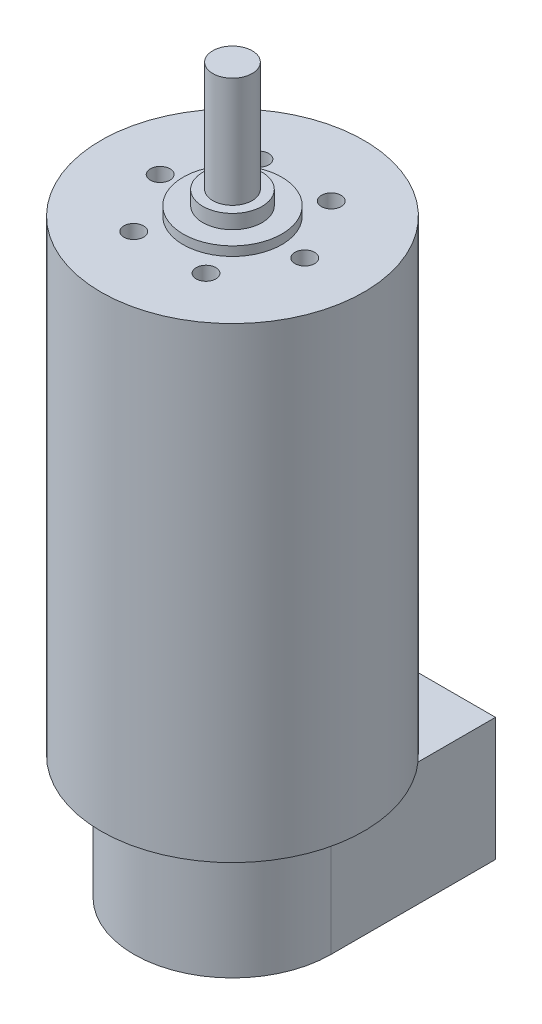
ISO-10303-21;
HEADER;
FILE_DESCRIPTION(('STEP AP214'),'2;1');
FILE_NAME('part.step','',(''),(''),'','','');
FILE_SCHEMA(('AUTOMOTIVE_DESIGN { 1 0 10303 214 1 1 1 1 }'));
ENDSEC;
DATA;
#1=APPLICATION_CONTEXT('core data for automotive mechanical design processes');
#2=APPLICATION_PROTOCOL_DEFINITION('international standard','automotive_design',2000,#1);
#3=PRODUCT_CONTEXT('',#1,'mechanical');
#4=PRODUCT('Part','Part','',(#3));
#5=PRODUCT_RELATED_PRODUCT_CATEGORY('part','',(#4));
#6=PRODUCT_DEFINITION_FORMATION('','',#4);
#7=PRODUCT_DEFINITION_CONTEXT('part definition',#1,'design');
#8=PRODUCT_DEFINITION('design','',#6,#7);
#9=PRODUCT_DEFINITION_SHAPE('','',#8);
#10=(LENGTH_UNIT() NAMED_UNIT(*) SI_UNIT(.MILLI.,.METRE.));
#11=(NAMED_UNIT(*) PLANE_ANGLE_UNIT() SI_UNIT($,.RADIAN.));
#12=(NAMED_UNIT(*) SI_UNIT($,.STERADIAN.) SOLID_ANGLE_UNIT());
#13=UNCERTAINTY_MEASURE_WITH_UNIT(LENGTH_MEASURE(1.E-05),#10,'distance_accuracy_value','');
#14=(GEOMETRIC_REPRESENTATION_CONTEXT(3) GLOBAL_UNCERTAINTY_ASSIGNED_CONTEXT((#13)) GLOBAL_UNIT_ASSIGNED_CONTEXT((#10,
#11,#12)) REPRESENTATION_CONTEXT('',''));
#15=CARTESIAN_POINT('',(0.,0.,0.));
#16=DIRECTION('',(0.,0.,1.));
#17=DIRECTION('',(1.,0.,0.));
#18=AXIS2_PLACEMENT_3D('',#15,#16,#17);
#19=CARTESIAN_POINT('',(0.,0.,0.));
#20=DIRECTION('',(0.,1.,0.));
#21=DIRECTION('',(0.,0.,1.));
#22=AXIS2_PLACEMENT_3D('',#19,#20,#21);
#23=PLANE('',#22);
#24=DIRECTION('',(0.,0.,1.));
#25=VECTOR('',#24,1.);
#26=CARTESIAN_POINT('',(15.,0.,0.));
#27=LINE('',#26,#25);
#28=CARTESIAN_POINT('',(15.,0.,-13.2287565553229));
#29=VERTEX_POINT('',#28);
#30=CARTESIAN_POINT('',(15.,0.,0.));
#31=VERTEX_POINT('',#30);
#32=EDGE_CURVE('E11',#29,#31,#27,.T.);
#33=ORIENTED_EDGE('',*,*,#32,.F.);
#34=CARTESIAN_POINT('',(0.,0.,0.));
#35=DIRECTION('',(0.,1.,0.));
#36=DIRECTION('',(0.,0.,1.));
#37=AXIS2_PLACEMENT_3D('',#34,#35,#36);
#38=CIRCLE('',#37,20.);
#39=CARTESIAN_POINT('',(-15.,0.,-13.2287565553229));
#40=VERTEX_POINT('',#39);
#41=EDGE_CURVE('E188',#40,#29,#38,.T.);
#42=ORIENTED_EDGE('',*,*,#41,.F.);
#43=DIRECTION('',(0.,0.,-1.));
#44=VECTOR('',#43,1.);
#45=CARTESIAN_POINT('',(-15.,0.,0.));
#46=LINE('',#45,#44);
#47=CARTESIAN_POINT('',(-15.,0.,0.));
#48=VERTEX_POINT('',#47);
#49=EDGE_CURVE('E64',#48,#40,#46,.T.);
#50=ORIENTED_EDGE('',*,*,#49,.F.);
#51=CARTESIAN_POINT('',(0.,0.,0.));
#52=DIRECTION('',(0.,-1.,0.));
#53=DIRECTION('',(0.,0.,-1.));
#54=AXIS2_PLACEMENT_3D('',#51,#52,#53);
#55=CIRCLE('',#54,15.);
#56=EDGE_CURVE('E60',#31,#48,#55,.T.);
#57=ORIENTED_EDGE('',*,*,#56,.F.);
#58=EDGE_LOOP('',(#33,#42,#50,#57));
#59=FACE_BOUND('',#58,.T.);
#60=ADVANCED_FACE('F41',(#59),#23,.F.);
#61=CARTESIAN_POINT('',(0.,71.,0.));
#62=DIRECTION('',(0.,-1.,0.));
#63=DIRECTION('',(0.,0.,-1.));
#64=AXIS2_PLACEMENT_3D('',#61,#62,#63);
#65=CYLINDRICAL_SURFACE('',#64,20.);
#66=CARTESIAN_POINT('',(0.,71.,0.));
#67=DIRECTION('',(0.,1.,0.));
#68=DIRECTION('',(0.,0.,1.));
#69=AXIS2_PLACEMENT_3D('',#66,#67,#68);
#70=CIRCLE('',#69,20.);
#71=CARTESIAN_POINT('',(0.,71.,20.));
#72=VERTEX_POINT('',#71);
#73=EDGE_CURVE('E191',#72,#72,#70,.T.);
#74=ORIENTED_EDGE('',*,*,#73,.F.);
#75=EDGE_LOOP('',(#74));
#76=FACE_BOUND('',#75,.T.);
#77=EDGE_CURVE('E45',#29,#40,#38,.T.);
#78=ORIENTED_EDGE('',*,*,#77,.T.);
#79=ORIENTED_EDGE('',*,*,#41,.T.);
#80=EDGE_LOOP('',(#78,#79));
#81=FACE_BOUND('',#80,.T.);
#82=ADVANCED_FACE('F43',(#76,#81),#65,.T.);
#83=CARTESIAN_POINT('',(0.,71.,0.));
#84=DIRECTION('',(0.,1.,0.));
#85=DIRECTION('',(0.,0.,1.));
#86=AXIS2_PLACEMENT_3D('',#83,#84,#85);
#87=PLANE('',#86);
#88=CARTESIAN_POINT('',(-5.50000000000011,71.,9.52627944162876));
#89=DIRECTION('',(0.,1.,0.));
#90=DIRECTION('',(0.866025403784433,0.,0.50000000000001));
#91=AXIS2_PLACEMENT_3D('',#88,#89,#90);
#92=CIRCLE('',#91,1.5);
#93=CARTESIAN_POINT('',(-4.20096189432346,71.,10.2762794416288));
#94=VERTEX_POINT('',#93);
#95=EDGE_CURVE('E114',#94,#94,#92,.T.);
#96=ORIENTED_EDGE('',*,*,#95,.F.);
#97=EDGE_LOOP('',(#96));
#98=FACE_BOUND('',#97,.T.);
#99=CARTESIAN_POINT('',(5.49999999999991,71.,9.52627944162887));
#100=DIRECTION('',(0.,1.,0.));
#101=DIRECTION('',(0.866025403784443,0.,-0.499999999999992));
#102=AXIS2_PLACEMENT_3D('',#99,#100,#101);
#103=CIRCLE('',#102,1.5);
#104=CARTESIAN_POINT('',(6.79903810567658,71.,8.77627944162889));
#105=VERTEX_POINT('',#104);
#106=EDGE_CURVE('E146',#105,#105,#103,.T.);
#107=ORIENTED_EDGE('',*,*,#106,.F.);
#108=EDGE_LOOP('',(#107));
#109=FACE_BOUND('',#108,.T.);
#110=CARTESIAN_POINT('',(11.,71.,0.));
#111=DIRECTION('',(0.,1.,0.));
#112=DIRECTION('',(0.,0.,-1.));
#113=AXIS2_PLACEMENT_3D('',#110,#111,#112);
#114=CIRCLE('',#113,1.5);
#115=CARTESIAN_POINT('',(11.,71.,-1.5));
#116=VERTEX_POINT('',#115);
#117=EDGE_CURVE('E138',#116,#116,#114,.T.);
#118=ORIENTED_EDGE('',*,*,#117,.F.);
#119=EDGE_LOOP('',(#118));
#120=FACE_BOUND('',#119,.T.);
#121=CARTESIAN_POINT('',(5.50000000000004,71.,-9.5262794416288));
#122=DIRECTION('',(0.,1.,0.));
#123=DIRECTION('',(-0.866025403784436,0.,-0.500000000000004));
#124=AXIS2_PLACEMENT_3D('',#121,#122,#123);
#125=CIRCLE('',#124,1.5);
#126=CARTESIAN_POINT('',(4.20096189432339,71.,-10.2762794416288));
#127=VERTEX_POINT('',#126);
#128=EDGE_CURVE('E130',#127,#127,#125,.T.);
#129=ORIENTED_EDGE('',*,*,#128,.F.);
#130=EDGE_LOOP('',(#129));
#131=FACE_BOUND('',#130,.T.);
#132=CARTESIAN_POINT('',(-5.49999999999998,71.,-9.52627944162884));
#133=DIRECTION('',(0.,1.,0.));
#134=DIRECTION('',(-0.86602540378444,0.,0.499999999999998));
#135=AXIS2_PLACEMENT_3D('',#132,#133,#134);
#136=CIRCLE('',#135,1.5);
#137=CARTESIAN_POINT('',(-6.79903810567664,71.,-8.77627944162884));
#138=VERTEX_POINT('',#137);
#139=EDGE_CURVE('E129',#138,#138,#136,.T.);
#140=ORIENTED_EDGE('',*,*,#139,.F.);
#141=EDGE_LOOP('',(#140));
#142=FACE_BOUND('',#141,.T.);
#143=CARTESIAN_POINT('',(-11.,71.,0.));
#144=DIRECTION('',(0.,1.,0.));
#145=DIRECTION('',(0.,0.,1.));
#146=AXIS2_PLACEMENT_3D('',#143,#144,#145);
#147=CIRCLE('',#146,1.5);
#148=CARTESIAN_POINT('',(-11.,71.,1.5));
#149=VERTEX_POINT('',#148);
#150=EDGE_CURVE('E157',#149,#149,#147,.T.);
#151=ORIENTED_EDGE('',*,*,#150,.F.);
#152=EDGE_LOOP('',(#151));
#153=FACE_BOUND('',#152,.T.);
#154=CARTESIAN_POINT('',(0.,71.,0.));
#155=DIRECTION('',(0.,1.,0.));
#156=DIRECTION('',(0.,0.,1.));
#157=AXIS2_PLACEMENT_3D('',#154,#155,#156);
#158=CIRCLE('',#157,7.5);
#159=CARTESIAN_POINT('',(0.,71.,7.5));
#160=VERTEX_POINT('',#159);
#161=EDGE_CURVE('E184',#160,#160,#158,.T.);
#162=ORIENTED_EDGE('',*,*,#161,.F.);
#163=EDGE_LOOP('',(#162));
#164=FACE_BOUND('',#163,.T.);
#165=ORIENTED_EDGE('',*,*,#73,.T.);
#166=EDGE_LOOP('',(#165));
#167=FACE_BOUND('',#166,.T.);
#168=ADVANCED_FACE('F244',(#98,#109,#120,#131,#142,#153,#164,#167),#87,.T.);
#169=CARTESIAN_POINT('',(0.,72.4,0.));
#170=DIRECTION('',(0.,-1.,0.));
#171=DIRECTION('',(0.,0.,-1.));
#172=AXIS2_PLACEMENT_3D('',#169,#170,#171);
#173=CYLINDRICAL_SURFACE('',#172,7.5);
#174=CARTESIAN_POINT('',(0.,72.4,0.));
#175=DIRECTION('',(0.,1.,0.));
#176=DIRECTION('',(0.,0.,1.));
#177=AXIS2_PLACEMENT_3D('',#174,#175,#176);
#178=CIRCLE('',#177,7.5);
#179=CARTESIAN_POINT('',(0.,72.4,7.5));
#180=VERTEX_POINT('',#179);
#181=EDGE_CURVE('E180',#180,#180,#178,.T.);
#182=ORIENTED_EDGE('',*,*,#181,.F.);
#183=EDGE_LOOP('',(#182));
#184=FACE_BOUND('',#183,.T.);
#185=ORIENTED_EDGE('',*,*,#161,.T.);
#186=EDGE_LOOP('',(#185));
#187=FACE_BOUND('',#186,.T.);
#188=ADVANCED_FACE('F249',(#184,#187),#173,.T.);
#189=CARTESIAN_POINT('',(0.,72.4,0.));
#190=DIRECTION('',(0.,1.,0.));
#191=DIRECTION('',(0.,0.,1.));
#192=AXIS2_PLACEMENT_3D('',#189,#190,#191);
#193=PLANE('',#192);
#194=CARTESIAN_POINT('',(0.,72.4,0.));
#195=DIRECTION('',(0.,1.,0.));
#196=DIRECTION('',(0.,0.,1.));
#197=AXIS2_PLACEMENT_3D('',#194,#195,#196);
#198=CIRCLE('',#197,4.5);
#199=CARTESIAN_POINT('',(0.,72.4,4.5));
#200=VERTEX_POINT('',#199);
#201=EDGE_CURVE('E176',#200,#200,#198,.T.);
#202=ORIENTED_EDGE('',*,*,#201,.F.);
#203=EDGE_LOOP('',(#202));
#204=FACE_BOUND('',#203,.T.);
#205=ORIENTED_EDGE('',*,*,#181,.T.);
#206=EDGE_LOOP('',(#205));
#207=FACE_BOUND('',#206,.T.);
#208=ADVANCED_FACE('F253',(#204,#207),#193,.T.);
#209=CARTESIAN_POINT('',(0.,74.55,0.));
#210=DIRECTION('',(0.,-1.,0.));
#211=DIRECTION('',(0.,0.,-1.));
#212=AXIS2_PLACEMENT_3D('',#209,#210,#211);
#213=CYLINDRICAL_SURFACE('',#212,4.5);
#214=CARTESIAN_POINT('',(0.,74.55,0.));
#215=DIRECTION('',(0.,1.,0.));
#216=DIRECTION('',(0.,0.,1.));
#217=AXIS2_PLACEMENT_3D('',#214,#215,#216);
#218=CIRCLE('',#217,4.5);
#219=CARTESIAN_POINT('',(0.,74.55,4.5));
#220=VERTEX_POINT('',#219);
#221=EDGE_CURVE('E172',#220,#220,#218,.T.);
#222=ORIENTED_EDGE('',*,*,#221,.F.);
#223=EDGE_LOOP('',(#222));
#224=FACE_BOUND('',#223,.T.);
#225=ORIENTED_EDGE('',*,*,#201,.T.);
#226=EDGE_LOOP('',(#225));
#227=FACE_BOUND('',#226,.T.);
#228=ADVANCED_FACE('F257',(#224,#227),#213,.T.);
#229=CARTESIAN_POINT('',(0.,74.55,0.));
#230=DIRECTION('',(0.,1.,0.));
#231=DIRECTION('',(0.,0.,1.));
#232=AXIS2_PLACEMENT_3D('',#229,#230,#231);
#233=PLANE('',#232);
#234=CARTESIAN_POINT('',(0.,74.55,0.));
#235=DIRECTION('',(0.,1.,0.));
#236=DIRECTION('',(0.,0.,1.));
#237=AXIS2_PLACEMENT_3D('',#234,#235,#236);
#238=CIRCLE('',#237,3.);
#239=CARTESIAN_POINT('',(0.,74.55,3.));
#240=VERTEX_POINT('',#239);
#241=EDGE_CURVE('E51',#240,#240,#238,.T.);
#242=ORIENTED_EDGE('',*,*,#241,.F.);
#243=EDGE_LOOP('',(#242));
#244=FACE_BOUND('',#243,.T.);
#245=ORIENTED_EDGE('',*,*,#221,.T.);
#246=EDGE_LOOP('',(#245));
#247=FACE_BOUND('',#246,.T.);
#248=ADVANCED_FACE('F261',(#244,#247),#233,.T.);
#249=CARTESIAN_POINT('',(0.,91.3,0.));
#250=DIRECTION('',(0.,-1.,0.));
#251=DIRECTION('',(0.,0.,-1.));
#252=AXIS2_PLACEMENT_3D('',#249,#250,#251);
#253=CYLINDRICAL_SURFACE('',#252,3.);
#254=CARTESIAN_POINT('',(0.,91.3,0.));
#255=DIRECTION('',(0.,1.,0.));
#256=DIRECTION('',(0.,0.,1.));
#257=AXIS2_PLACEMENT_3D('',#254,#255,#256);
#258=CIRCLE('',#257,3.);
#259=CARTESIAN_POINT('',(0.,91.3,3.));
#260=VERTEX_POINT('',#259);
#261=EDGE_CURVE('E165',#260,#260,#258,.T.);
#262=ORIENTED_EDGE('',*,*,#261,.F.);
#263=EDGE_LOOP('',(#262));
#264=FACE_BOUND('',#263,.T.);
#265=ORIENTED_EDGE('',*,*,#241,.T.);
#266=EDGE_LOOP('',(#265));
#267=FACE_BOUND('',#266,.T.);
#268=ADVANCED_FACE('F265',(#264,#267),#253,.T.);
#269=CARTESIAN_POINT('',(0.,91.3,0.));
#270=DIRECTION('',(0.,1.,0.));
#271=DIRECTION('',(0.,0.,1.));
#272=AXIS2_PLACEMENT_3D('',#269,#270,#271);
#273=PLANE('',#272);
#274=ORIENTED_EDGE('',*,*,#261,.T.);
#275=EDGE_LOOP('',(#274));
#276=FACE_BOUND('',#275,.T.);
#277=ADVANCED_FACE('F269',(#276),#273,.T.);
#278=CARTESIAN_POINT('',(-11.,66.,0.));
#279=DIRECTION('',(0.,1.,0.));
#280=DIRECTION('',(0.,0.,1.));
#281=AXIS2_PLACEMENT_3D('',#278,#279,#280);
#282=CYLINDRICAL_SURFACE('',#281,1.5);
#283=CARTESIAN_POINT('',(-11.,66.,0.));
#284=DIRECTION('',(0.,1.,0.));
#285=DIRECTION('',(0.,0.,1.));
#286=AXIS2_PLACEMENT_3D('',#283,#284,#285);
#287=CIRCLE('',#286,1.5);
#288=CARTESIAN_POINT('',(-11.,66.,1.5));
#289=VERTEX_POINT('',#288);
#290=EDGE_CURVE('E161',#289,#289,#287,.T.);
#291=ORIENTED_EDGE('',*,*,#290,.F.);
#292=EDGE_LOOP('',(#291));
#293=FACE_BOUND('',#292,.T.);
#294=ORIENTED_EDGE('',*,*,#150,.T.);
#295=EDGE_LOOP('',(#294));
#296=FACE_BOUND('',#295,.T.);
#297=ADVANCED_FACE('F273',(#293,#296),#282,.F.);
#298=CARTESIAN_POINT('',(-11.,66.,0.));
#299=DIRECTION('',(0.,1.,0.));
#300=DIRECTION('',(0.,0.,1.));
#301=AXIS2_PLACEMENT_3D('',#298,#299,#300);
#302=PLANE('',#301);
#303=ORIENTED_EDGE('',*,*,#290,.T.);
#304=EDGE_LOOP('',(#303));
#305=FACE_BOUND('',#304,.T.);
#306=ADVANCED_FACE('F277',(#305),#302,.T.);
#307=CARTESIAN_POINT('',(-5.49999999999998,66.,-9.52627944162884));
#308=DIRECTION('',(0.,1.,0.));
#309=DIRECTION('',(0.,0.,1.));
#310=AXIS2_PLACEMENT_3D('',#307,#308,#309);
#311=CYLINDRICAL_SURFACE('',#310,1.5);
#312=CARTESIAN_POINT('',(-5.49999999999998,66.,-9.52627944162884));
#313=DIRECTION('',(0.,1.,0.));
#314=DIRECTION('',(-0.86602540378444,0.,0.499999999999998));
#315=AXIS2_PLACEMENT_3D('',#312,#313,#314);
#316=CIRCLE('',#315,1.5);
#317=CARTESIAN_POINT('',(-6.79903810567664,66.,-8.77627944162884));
#318=VERTEX_POINT('',#317);
#319=EDGE_CURVE('E153',#318,#318,#316,.T.);
#320=ORIENTED_EDGE('',*,*,#319,.F.);
#321=EDGE_LOOP('',(#320));
#322=FACE_BOUND('',#321,.T.);
#323=ORIENTED_EDGE('',*,*,#139,.T.);
#324=EDGE_LOOP('',(#323));
#325=FACE_BOUND('',#324,.T.);
#326=ADVANCED_FACE('F281',(#322,#325),#311,.F.);
#327=CARTESIAN_POINT('',(-5.49999999999998,66.,-9.52627944162884));
#328=DIRECTION('',(0.,1.,0.));
#329=DIRECTION('',(-0.86602540378444,0.,0.499999999999998));
#330=AXIS2_PLACEMENT_3D('',#327,#328,#329);
#331=PLANE('',#330);
#332=ORIENTED_EDGE('',*,*,#319,.T.);
#333=EDGE_LOOP('',(#332));
#334=FACE_BOUND('',#333,.T.);
#335=ADVANCED_FACE('F285',(#334),#331,.T.);
#336=CARTESIAN_POINT('',(5.50000000000004,66.,-9.5262794416288));
#337=DIRECTION('',(0.,1.,0.));
#338=DIRECTION('',(0.,0.,1.));
#339=AXIS2_PLACEMENT_3D('',#336,#337,#338);
#340=CYLINDRICAL_SURFACE('',#339,1.5);
#341=CARTESIAN_POINT('',(5.50000000000004,66.,-9.5262794416288));
#342=DIRECTION('',(0.,1.,0.));
#343=DIRECTION('',(-0.866025403784436,0.,-0.500000000000004));
#344=AXIS2_PLACEMENT_3D('',#341,#342,#343);
#345=CIRCLE('',#344,1.5);
#346=CARTESIAN_POINT('',(4.20096189432339,66.,-10.2762794416288));
#347=VERTEX_POINT('',#346);
#348=EDGE_CURVE('E125',#347,#347,#345,.T.);
#349=ORIENTED_EDGE('',*,*,#348,.F.);
#350=EDGE_LOOP('',(#349));
#351=FACE_BOUND('',#350,.T.);
#352=ORIENTED_EDGE('',*,*,#128,.T.);
#353=EDGE_LOOP('',(#352));
#354=FACE_BOUND('',#353,.T.);
#355=ADVANCED_FACE('F289',(#351,#354),#340,.F.);
#356=CARTESIAN_POINT('',(5.50000000000004,66.,-9.5262794416288));
#357=DIRECTION('',(0.,1.,0.));
#358=DIRECTION('',(-0.866025403784436,0.,-0.500000000000004));
#359=AXIS2_PLACEMENT_3D('',#356,#357,#358);
#360=PLANE('',#359);
#361=ORIENTED_EDGE('',*,*,#348,.T.);
#362=EDGE_LOOP('',(#361));
#363=FACE_BOUND('',#362,.T.);
#364=ADVANCED_FACE('F311',(#363),#360,.T.);
#365=CARTESIAN_POINT('',(11.,66.,0.));
#366=DIRECTION('',(0.,1.,0.));
#367=DIRECTION('',(0.,0.,1.));
#368=AXIS2_PLACEMENT_3D('',#365,#366,#367);
#369=CYLINDRICAL_SURFACE('',#368,1.5);
#370=CARTESIAN_POINT('',(11.,66.,0.));
#371=DIRECTION('',(0.,1.,0.));
#372=DIRECTION('',(0.,0.,-1.));
#373=AXIS2_PLACEMENT_3D('',#370,#371,#372);
#374=CIRCLE('',#373,1.5);
#375=CARTESIAN_POINT('',(11.,66.,-1.5));
#376=VERTEX_POINT('',#375);
#377=EDGE_CURVE('E134',#376,#376,#374,.T.);
#378=ORIENTED_EDGE('',*,*,#377,.F.);
#379=EDGE_LOOP('',(#378));
#380=FACE_BOUND('',#379,.T.);
#381=ORIENTED_EDGE('',*,*,#117,.T.);
#382=EDGE_LOOP('',(#381));
#383=FACE_BOUND('',#382,.T.);
#384=ADVANCED_FACE('F308',(#380,#383),#369,.F.);
#385=CARTESIAN_POINT('',(11.,66.,0.));
#386=DIRECTION('',(0.,1.,0.));
#387=DIRECTION('',(0.,0.,-1.));
#388=AXIS2_PLACEMENT_3D('',#385,#386,#387);
#389=PLANE('',#388);
#390=ORIENTED_EDGE('',*,*,#377,.T.);
#391=EDGE_LOOP('',(#390));
#392=FACE_BOUND('',#391,.T.);
#393=ADVANCED_FACE('F303',(#392),#389,.T.);
#394=CARTESIAN_POINT('',(5.49999999999991,66.,9.52627944162887));
#395=DIRECTION('',(0.,1.,0.));
#396=DIRECTION('',(0.,0.,1.));
#397=AXIS2_PLACEMENT_3D('',#394,#395,#396);
#398=CYLINDRICAL_SURFACE('',#397,1.5);
#399=CARTESIAN_POINT('',(5.49999999999991,66.,9.52627944162887));
#400=DIRECTION('',(0.,1.,0.));
#401=DIRECTION('',(0.866025403784443,0.,-0.499999999999992));
#402=AXIS2_PLACEMENT_3D('',#399,#400,#401);
#403=CIRCLE('',#402,1.5);
#404=CARTESIAN_POINT('',(6.79903810567658,66.,8.77627944162889));
#405=VERTEX_POINT('',#404);
#406=EDGE_CURVE('E142',#405,#405,#403,.T.);
#407=ORIENTED_EDGE('',*,*,#406,.F.);
#408=EDGE_LOOP('',(#407));
#409=FACE_BOUND('',#408,.T.);
#410=ORIENTED_EDGE('',*,*,#106,.T.);
#411=EDGE_LOOP('',(#410));
#412=FACE_BOUND('',#411,.T.);
#413=ADVANCED_FACE('F300',(#409,#412),#398,.F.);
#414=CARTESIAN_POINT('',(5.49999999999991,66.,9.52627944162887));
#415=DIRECTION('',(0.,1.,0.));
#416=DIRECTION('',(0.866025403784443,0.,-0.499999999999992));
#417=AXIS2_PLACEMENT_3D('',#414,#415,#416);
#418=PLANE('',#417);
#419=ORIENTED_EDGE('',*,*,#406,.T.);
#420=EDGE_LOOP('',(#419));
#421=FACE_BOUND('',#420,.T.);
#422=ADVANCED_FACE('F295',(#421),#418,.T.);
#423=CARTESIAN_POINT('',(-5.50000000000011,66.,9.52627944162876));
#424=DIRECTION('',(0.,1.,0.));
#425=DIRECTION('',(0.,0.,1.));
#426=AXIS2_PLACEMENT_3D('',#423,#424,#425);
#427=CYLINDRICAL_SURFACE('',#426,1.5);
#428=CARTESIAN_POINT('',(-5.50000000000011,66.,9.52627944162876));
#429=DIRECTION('',(0.,1.,0.));
#430=DIRECTION('',(0.866025403784433,0.,0.50000000000001));
#431=AXIS2_PLACEMENT_3D('',#428,#429,#430);
#432=CIRCLE('',#431,1.5);
#433=CARTESIAN_POINT('',(-4.20096189432346,66.,10.2762794416288));
#434=VERTEX_POINT('',#433);
#435=EDGE_CURVE('E119',#434,#434,#432,.T.);
#436=ORIENTED_EDGE('',*,*,#435,.F.);
#437=EDGE_LOOP('',(#436));
#438=FACE_BOUND('',#437,.T.);
#439=ORIENTED_EDGE('',*,*,#95,.T.);
#440=EDGE_LOOP('',(#439));
#441=FACE_BOUND('',#440,.T.);
#442=ADVANCED_FACE('F291',(#438,#441),#427,.F.);
#443=CARTESIAN_POINT('',(-5.50000000000011,66.,9.52627944162876));
#444=DIRECTION('',(0.,1.,0.));
#445=DIRECTION('',(0.866025403784433,0.,0.50000000000001));
#446=AXIS2_PLACEMENT_3D('',#443,#444,#445);
#447=PLANE('',#446);
#448=ORIENTED_EDGE('',*,*,#435,.T.);
#449=EDGE_LOOP('',(#448));
#450=FACE_BOUND('',#449,.T.);
#451=ADVANCED_FACE('F294',(#450),#447,.T.);
#452=CARTESIAN_POINT('',(0.,-18.73,0.));
#453=DIRECTION('',(0.,1.,0.));
#454=DIRECTION('',(0.,0.,1.));
#455=AXIS2_PLACEMENT_3D('',#452,#453,#454);
#456=CYLINDRICAL_SURFACE('',#455,15.);
#457=ORIENTED_EDGE('',*,*,#56,.T.);
#458=DIRECTION('',(0.,1.,0.));
#459=VECTOR('',#458,1.);
#460=CARTESIAN_POINT('',(-15.,-18.73,0.));
#461=LINE('',#460,#459);
#462=CARTESIAN_POINT('',(-15.,-18.73,0.));
#463=VERTEX_POINT('',#462);
#464=EDGE_CURVE('E94',#463,#48,#461,.T.);
#465=ORIENTED_EDGE('',*,*,#464,.F.);
#466=CARTESIAN_POINT('',(0.,-18.73,0.));
#467=DIRECTION('',(0.,-1.,0.));
#468=DIRECTION('',(0.,0.,-1.));
#469=AXIS2_PLACEMENT_3D('',#466,#467,#468);
#470=CIRCLE('',#469,15.);
#471=CARTESIAN_POINT('',(15.,-18.73,0.));
#472=VERTEX_POINT('',#471);
#473=EDGE_CURVE('E101',#472,#463,#470,.T.);
#474=ORIENTED_EDGE('',*,*,#473,.F.);
#475=DIRECTION('',(0.,1.,0.));
#476=VECTOR('',#475,1.);
#477=CARTESIAN_POINT('',(15.,-18.73,0.));
#478=LINE('',#477,#476);
#479=EDGE_CURVE('E218',#472,#31,#478,.T.);
#480=ORIENTED_EDGE('',*,*,#479,.T.);
#481=EDGE_LOOP('',(#457,#465,#474,#480));
#482=FACE_BOUND('',#481,.T.);
#483=ADVANCED_FACE('F112',(#482),#456,.T.);
#484=CARTESIAN_POINT('',(-15.,-18.73,0.));
#485=DIRECTION('',(1.,0.,0.));
#486=DIRECTION('',(0.,0.,-1.));
#487=AXIS2_PLACEMENT_3D('',#484,#485,#486);
#488=PLANE('',#487);
#489=ORIENTED_EDGE('',*,*,#49,.T.);
#490=CARTESIAN_POINT('',(-15.,0.,-25.));
#491=VERTEX_POINT('',#490);
#492=EDGE_CURVE('E207',#40,#491,#46,.T.);
#493=ORIENTED_EDGE('',*,*,#492,.T.);
#494=DIRECTION('',(0.,1.,0.));
#495=VECTOR('',#494,1.);
#496=CARTESIAN_POINT('',(-15.,-18.73,-25.));
#497=LINE('',#496,#495);
#498=CARTESIAN_POINT('',(-15.,-18.73,-25.));
#499=VERTEX_POINT('',#498);
#500=EDGE_CURVE('E96',#499,#491,#497,.T.);
#501=ORIENTED_EDGE('',*,*,#500,.F.);
#502=DIRECTION('',(0.,0.,-1.));
#503=VECTOR('',#502,1.);
#504=CARTESIAN_POINT('',(-15.,-18.73,0.));
#505=LINE('',#504,#503);
#506=EDGE_CURVE('E90',#463,#499,#505,.T.);
#507=ORIENTED_EDGE('',*,*,#506,.F.);
#508=ORIENTED_EDGE('',*,*,#464,.T.);
#509=EDGE_LOOP('',(#489,#493,#501,#507,#508));
#510=FACE_BOUND('',#509,.T.);
#511=ADVANCED_FACE('F92',(#510),#488,.F.);
#512=CARTESIAN_POINT('',(-15.,-18.73,-25.));
#513=DIRECTION('',(0.,0.,1.));
#514=DIRECTION('',(1.,0.,0.));
#515=AXIS2_PLACEMENT_3D('',#512,#513,#514);
#516=PLANE('',#515);
#517=DIRECTION('',(1.,0.,0.));
#518=VECTOR('',#517,1.);
#519=CARTESIAN_POINT('',(-15.,0.,-25.));
#520=LINE('',#519,#518);
#521=CARTESIAN_POINT('',(15.,0.,-25.));
#522=VERTEX_POINT('',#521);
#523=EDGE_CURVE('E213',#491,#522,#520,.T.);
#524=ORIENTED_EDGE('',*,*,#523,.T.);
#525=DIRECTION('',(0.,1.,0.));
#526=VECTOR('',#525,1.);
#527=CARTESIAN_POINT('',(15.,-18.73,-25.));
#528=LINE('',#527,#526);
#529=CARTESIAN_POINT('',(15.,-18.73,-25.));
#530=VERTEX_POINT('',#529);
#531=EDGE_CURVE('E121',#530,#522,#528,.T.);
#532=ORIENTED_EDGE('',*,*,#531,.F.);
#533=DIRECTION('',(1.,0.,0.));
#534=VECTOR('',#533,1.);
#535=CARTESIAN_POINT('',(-15.,-18.73,-25.));
#536=LINE('',#535,#534);
#537=EDGE_CURVE('E100',#499,#530,#536,.T.);
#538=ORIENTED_EDGE('',*,*,#537,.F.);
#539=ORIENTED_EDGE('',*,*,#500,.T.);
#540=EDGE_LOOP('',(#524,#532,#538,#539));
#541=FACE_BOUND('',#540,.T.);
#542=ADVANCED_FACE('F230',(#541),#516,.F.);
#543=CARTESIAN_POINT('',(15.,-18.73,0.));
#544=DIRECTION('',(-1.,0.,0.));
#545=DIRECTION('',(0.,0.,1.));
#546=AXIS2_PLACEMENT_3D('',#543,#544,#545);
#547=PLANE('',#546);
#548=EDGE_CURVE('E53',#522,#29,#27,.T.);
#549=ORIENTED_EDGE('',*,*,#548,.T.);
#550=ORIENTED_EDGE('',*,*,#32,.T.);
#551=ORIENTED_EDGE('',*,*,#479,.F.);
#552=DIRECTION('',(0.,0.,1.));
#553=VECTOR('',#552,1.);
#554=CARTESIAN_POINT('',(15.,-18.73,0.));
#555=LINE('',#554,#553);
#556=EDGE_CURVE('E106',#530,#472,#555,.T.);
#557=ORIENTED_EDGE('',*,*,#556,.F.);
#558=ORIENTED_EDGE('',*,*,#531,.T.);
#559=EDGE_LOOP('',(#549,#550,#551,#557,#558));
#560=FACE_BOUND('',#559,.T.);
#561=ADVANCED_FACE('F210',(#560),#547,.F.);
#562=CARTESIAN_POINT('',(0.,-18.73,0.));
#563=DIRECTION('',(0.,-1.,0.));
#564=DIRECTION('',(0.,0.,-1.));
#565=AXIS2_PLACEMENT_3D('',#562,#563,#564);
#566=PLANE('',#565);
#567=ORIENTED_EDGE('',*,*,#473,.T.);
#568=ORIENTED_EDGE('',*,*,#506,.T.);
#569=ORIENTED_EDGE('',*,*,#537,.T.);
#570=ORIENTED_EDGE('',*,*,#556,.T.);
#571=EDGE_LOOP('',(#567,#568,#569,#570));
#572=FACE_BOUND('',#571,.T.);
#573=ADVANCED_FACE('F104',(#572),#566,.T.);
#574=CARTESIAN_POINT('',(0.,0.,0.));
#575=DIRECTION('',(0.,-1.,0.));
#576=DIRECTION('',(0.,0.,-1.));
#577=AXIS2_PLACEMENT_3D('',#574,#575,#576);
#578=PLANE('',#577);
#579=ORIENTED_EDGE('',*,*,#77,.F.);
#580=ORIENTED_EDGE('',*,*,#548,.F.);
#581=ORIENTED_EDGE('',*,*,#523,.F.);
#582=ORIENTED_EDGE('',*,*,#492,.F.);
#583=EDGE_LOOP('',(#579,#580,#581,#582));
#584=FACE_BOUND('',#583,.T.);
#585=ADVANCED_FACE('F205',(#584),#578,.F.);
#586=CLOSED_SHELL('',(#60,#82,#168,#188,#208,#228,#248,#268,#277,#297,#306,#326,#335,#355,#364,
#384,#393,#413,#422,#442,#451,#483,#511,#542,#561,#573,#585));
#587=MANIFOLD_SOLID_BREP('B2',#586);
#588=ADVANCED_BREP_SHAPE_REPRESENTATION('',(#18,#587),#14);
#589=SHAPE_DEFINITION_REPRESENTATION(#9,#588);
ENDSEC;
END-ISO-10303-21;
